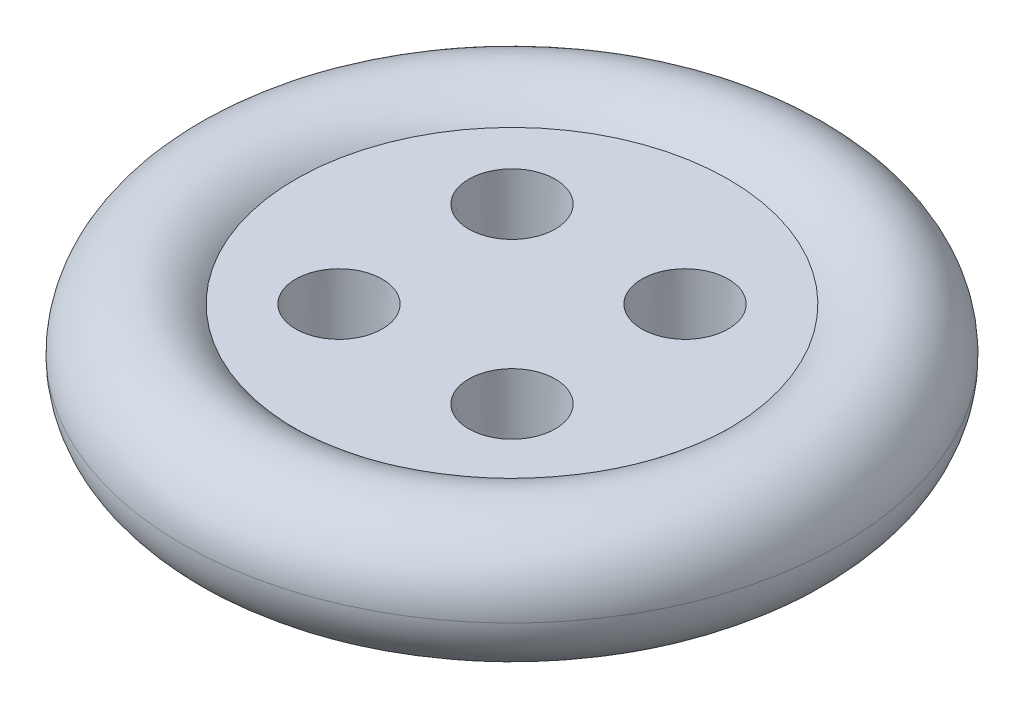
ISO-10303-21;
HEADER;
FILE_DESCRIPTION(('STEP AP214'),'2;1');
FILE_NAME('part.step','',(''),(''),'','','');
FILE_SCHEMA(('AUTOMOTIVE_DESIGN { 1 0 10303 214 1 1 1 1 }'));
ENDSEC;
DATA;
#1=APPLICATION_CONTEXT('core data for automotive mechanical design processes');
#2=APPLICATION_PROTOCOL_DEFINITION('international standard','automotive_design',2000,#1);
#3=PRODUCT_CONTEXT('',#1,'mechanical');
#4=PRODUCT('Part','Part','',(#3));
#5=PRODUCT_RELATED_PRODUCT_CATEGORY('part','',(#4));
#6=PRODUCT_DEFINITION_FORMATION('','',#4);
#7=PRODUCT_DEFINITION_CONTEXT('part definition',#1,'design');
#8=PRODUCT_DEFINITION('design','',#6,#7);
#9=PRODUCT_DEFINITION_SHAPE('','',#8);
#10=(LENGTH_UNIT() NAMED_UNIT(*) SI_UNIT(.MILLI.,.METRE.));
#11=(NAMED_UNIT(*) PLANE_ANGLE_UNIT() SI_UNIT($,.RADIAN.));
#12=(NAMED_UNIT(*) SI_UNIT($,.STERADIAN.) SOLID_ANGLE_UNIT());
#13=UNCERTAINTY_MEASURE_WITH_UNIT(LENGTH_MEASURE(1.E-05),#10,'distance_accuracy_value','');
#14=(GEOMETRIC_REPRESENTATION_CONTEXT(3) GLOBAL_UNCERTAINTY_ASSIGNED_CONTEXT((#13)) GLOBAL_UNIT_ASSIGNED_CONTEXT((#10,
#11,#12)) REPRESENTATION_CONTEXT('',''));
#15=CARTESIAN_POINT('',(0.,0.,0.));
#16=DIRECTION('',(0.,0.,1.));
#17=DIRECTION('',(1.,0.,0.));
#18=AXIS2_PLACEMENT_3D('',#15,#16,#17);
#19=CARTESIAN_POINT('',(0.,10.,0.));
#20=DIRECTION('',(0.,-1.,0.));
#21=DIRECTION('',(0.,0.,-1.));
#22=AXIS2_PLACEMENT_3D('',#19,#20,#21);
#23=TOROIDAL_SURFACE('',#22,61.180339887499,15.);
#24=CARTESIAN_POINT('',(0.,0.,0.));
#25=DIRECTION('',(0.,-1.,0.));
#26=DIRECTION('',(0.,0.,-1.));
#27=AXIS2_PLACEMENT_3D('',#24,#25,#26);
#28=CIRCLE('',#27,50.);
#29=CARTESIAN_POINT('',(0.,0.,-50.));
#30=VERTEX_POINT('',#29);
#31=EDGE_CURVE('E44',#30,#30,#28,.T.);
#32=ORIENTED_EDGE('',*,*,#31,.F.);
#33=EDGE_LOOP('',(#32));
#34=FACE_BOUND('',#33,.T.);
#35=CARTESIAN_POINT('',(0.,10.,0.));
#36=DIRECTION('',(0.,-1.,0.));
#37=DIRECTION('',(0.,0.,-1.));
#38=AXIS2_PLACEMENT_3D('',#35,#36,#37);
#39=CIRCLE('',#38,76.1803398874989);
#40=CARTESIAN_POINT('',(0.,10.,-76.1803398874989));
#41=VERTEX_POINT('',#40);
#42=EDGE_CURVE('E10',#41,#41,#39,.T.);
#43=ORIENTED_EDGE('',*,*,#42,.T.);
#44=EDGE_LOOP('',(#43));
#45=FACE_BOUND('',#44,.T.);
#46=ADVANCED_FACE('F37',(#34,#45),#23,.T.);
#47=CARTESIAN_POINT('',(0.,0.,0.));
#48=DIRECTION('',(0.,-1.,0.));
#49=DIRECTION('',(0.,0.,-1.));
#50=AXIS2_PLACEMENT_3D('',#47,#48,#49);
#51=PLANE('',#50);
#52=CARTESIAN_POINT('',(-20.,0.,20.0000000000041));
#53=DIRECTION('',(0.,-1.,0.));
#54=DIRECTION('',(0.,0.,-1.));
#55=AXIS2_PLACEMENT_3D('',#52,#53,#54);
#56=CIRCLE('',#55,9.65089870143983);
#57=CARTESIAN_POINT('',(-20.,0.,10.3491012985643));
#58=VERTEX_POINT('',#57);
#59=EDGE_CURVE('E53',#58,#58,#56,.T.);
#60=ORIENTED_EDGE('',*,*,#59,.F.);
#61=EDGE_LOOP('',(#60));
#62=FACE_BOUND('',#61,.T.);
#63=CARTESIAN_POINT('',(20.0000000000041,0.,20.0000000000041));
#64=DIRECTION('',(0.,-1.,0.));
#65=DIRECTION('',(0.,0.,-1.));
#66=AXIS2_PLACEMENT_3D('',#63,#64,#65);
#67=CIRCLE('',#66,9.65089870143854);
#68=CARTESIAN_POINT('',(20.0000000000041,0.,10.3491012985656));
#69=VERTEX_POINT('',#68);
#70=EDGE_CURVE('E59',#69,#69,#67,.T.);
#71=ORIENTED_EDGE('',*,*,#70,.F.);
#72=EDGE_LOOP('',(#71));
#73=FACE_BOUND('',#72,.T.);
#74=CARTESIAN_POINT('',(20.0000000000041,0.,-20.));
#75=DIRECTION('',(0.,-1.,0.));
#76=DIRECTION('',(0.,0.,-1.));
#77=AXIS2_PLACEMENT_3D('',#74,#75,#76);
#78=CIRCLE('',#77,9.65089870143453);
#79=CARTESIAN_POINT('',(20.0000000000041,0.,-29.6508987014345));
#80=VERTEX_POINT('',#79);
#81=EDGE_CURVE('E63',#80,#80,#78,.T.);
#82=ORIENTED_EDGE('',*,*,#81,.F.);
#83=EDGE_LOOP('',(#82));
#84=FACE_BOUND('',#83,.T.);
#85=CARTESIAN_POINT('',(-20.,0.,-20.));
#86=DIRECTION('',(0.,-1.,0.));
#87=DIRECTION('',(0.,0.,-1.));
#88=AXIS2_PLACEMENT_3D('',#85,#86,#87);
#89=CIRCLE('',#88,9.65089870143565);
#90=CARTESIAN_POINT('',(-20.,0.,-29.6508987014357));
#91=VERTEX_POINT('',#90);
#92=EDGE_CURVE('E60',#91,#91,#89,.T.);
#93=ORIENTED_EDGE('',*,*,#92,.F.);
#94=EDGE_LOOP('',(#93));
#95=FACE_BOUND('',#94,.T.);
#96=ORIENTED_EDGE('',*,*,#31,.T.);
#97=EDGE_LOOP('',(#96));
#98=FACE_BOUND('',#97,.T.);
#99=ADVANCED_FACE('F72',(#62,#73,#84,#95,#98),#51,.T.);
#100=ORIENTED_EDGE('',*,*,#42,.F.);
#101=EDGE_LOOP('',(#100));
#102=FACE_BOUND('',#101,.T.);
#103=CARTESIAN_POINT('',(0.,20.,0.));
#104=DIRECTION('',(0.,-1.,0.));
#105=DIRECTION('',(0.,0.,-1.));
#106=AXIS2_PLACEMENT_3D('',#103,#104,#105);
#107=CIRCLE('',#106,50.);
#108=CARTESIAN_POINT('',(0.,20.,-50.));
#109=VERTEX_POINT('',#108);
#110=EDGE_CURVE('E48',#109,#109,#107,.T.);
#111=ORIENTED_EDGE('',*,*,#110,.T.);
#112=EDGE_LOOP('',(#111));
#113=FACE_BOUND('',#112,.T.);
#114=ADVANCED_FACE('F75',(#102,#113),#23,.T.);
#115=CARTESIAN_POINT('',(0.,20.,0.));
#116=DIRECTION('',(0.,-1.,0.));
#117=DIRECTION('',(0.,0.,-1.));
#118=AXIS2_PLACEMENT_3D('',#115,#116,#117);
#119=PLANE('',#118);
#120=CARTESIAN_POINT('',(-20.,20.,20.0000000000041));
#121=DIRECTION('',(0.,1.,0.));
#122=DIRECTION('',(0.,0.,1.));
#123=AXIS2_PLACEMENT_3D('',#120,#121,#122);
#124=CIRCLE('',#123,10.0000000000042);
#125=CARTESIAN_POINT('',(-20.,20.,30.0000000000083));
#126=VERTEX_POINT('',#125);
#127=EDGE_CURVE('E94',#126,#126,#124,.T.);
#128=ORIENTED_EDGE('',*,*,#127,.F.);
#129=EDGE_LOOP('',(#128));
#130=FACE_BOUND('',#129,.T.);
#131=CARTESIAN_POINT('',(20.0000000000041,20.,20.0000000000041));
#132=DIRECTION('',(0.,1.,0.));
#133=DIRECTION('',(0.,0.,1.));
#134=AXIS2_PLACEMENT_3D('',#131,#132,#133);
#135=CIRCLE('',#134,10.0000000000029);
#136=CARTESIAN_POINT('',(20.0000000000041,20.,30.000000000007));
#137=VERTEX_POINT('',#136);
#138=EDGE_CURVE('E91',#137,#137,#135,.T.);
#139=ORIENTED_EDGE('',*,*,#138,.F.);
#140=EDGE_LOOP('',(#139));
#141=FACE_BOUND('',#140,.T.);
#142=CARTESIAN_POINT('',(20.0000000000041,20.,-20.));
#143=DIRECTION('',(0.,1.,0.));
#144=DIRECTION('',(0.,0.,1.));
#145=AXIS2_PLACEMENT_3D('',#142,#143,#144);
#146=CIRCLE('',#145,9.99999999999888);
#147=CARTESIAN_POINT('',(20.0000000000041,20.,-10.0000000000011));
#148=VERTEX_POINT('',#147);
#149=EDGE_CURVE('E89',#148,#148,#146,.T.);
#150=ORIENTED_EDGE('',*,*,#149,.F.);
#151=EDGE_LOOP('',(#150));
#152=FACE_BOUND('',#151,.T.);
#153=CARTESIAN_POINT('',(-20.,20.,-20.));
#154=DIRECTION('',(0.,1.,0.));
#155=DIRECTION('',(0.,0.,1.));
#156=AXIS2_PLACEMENT_3D('',#153,#154,#155);
#157=CIRCLE('',#156,10.);
#158=CARTESIAN_POINT('',(-20.,20.,-10.));
#159=VERTEX_POINT('',#158);
#160=EDGE_CURVE('E64',#159,#159,#157,.T.);
#161=ORIENTED_EDGE('',*,*,#160,.F.);
#162=EDGE_LOOP('',(#161));
#163=FACE_BOUND('',#162,.T.);
#164=ORIENTED_EDGE('',*,*,#110,.F.);
#165=EDGE_LOOP('',(#164));
#166=FACE_BOUND('',#165,.T.);
#167=ADVANCED_FACE('F85',(#130,#141,#152,#163,#166),#119,.F.);
#168=CARTESIAN_POINT('',(-20.,20.,-20.));
#169=DIRECTION('',(0.,1.,0.));
#170=DIRECTION('',(0.,0.,1.));
#171=AXIS2_PLACEMENT_3D('',#168,#169,#170);
#172=CONICAL_SURFACE('',#171,10.,0.0174532925199433);
#173=ORIENTED_EDGE('',*,*,#92,.T.);
#174=EDGE_LOOP('',(#173));
#175=FACE_BOUND('',#174,.T.);
#176=ORIENTED_EDGE('',*,*,#160,.T.);
#177=EDGE_LOOP('',(#176));
#178=FACE_BOUND('',#177,.T.);
#179=ADVANCED_FACE('F39',(#175,#178),#172,.F.);
#180=CARTESIAN_POINT('',(20.0000000000041,20.,-20.));
#181=DIRECTION('',(0.,1.,0.));
#182=DIRECTION('',(0.,0.,1.));
#183=AXIS2_PLACEMENT_3D('',#180,#181,#182);
#184=CONICAL_SURFACE('',#183,9.99999999999888,0.0174532925199433);
#185=ORIENTED_EDGE('',*,*,#81,.T.);
#186=EDGE_LOOP('',(#185));
#187=FACE_BOUND('',#186,.T.);
#188=ORIENTED_EDGE('',*,*,#149,.T.);
#189=EDGE_LOOP('',(#188));
#190=FACE_BOUND('',#189,.T.);
#191=ADVANCED_FACE('F84',(#187,#190),#184,.F.);
#192=CARTESIAN_POINT('',(20.0000000000041,20.,20.0000000000041));
#193=DIRECTION('',(0.,1.,0.));
#194=DIRECTION('',(0.,0.,1.));
#195=AXIS2_PLACEMENT_3D('',#192,#193,#194);
#196=CONICAL_SURFACE('',#195,10.0000000000029,0.0174532925199433);
#197=ORIENTED_EDGE('',*,*,#70,.T.);
#198=EDGE_LOOP('',(#197));
#199=FACE_BOUND('',#198,.T.);
#200=ORIENTED_EDGE('',*,*,#138,.T.);
#201=EDGE_LOOP('',(#200));
#202=FACE_BOUND('',#201,.T.);
#203=ADVANCED_FACE('F69',(#199,#202),#196,.F.);
#204=CARTESIAN_POINT('',(-20.,20.,20.0000000000041));
#205=DIRECTION('',(0.,1.,0.));
#206=DIRECTION('',(0.,0.,1.));
#207=AXIS2_PLACEMENT_3D('',#204,#205,#206);
#208=CONICAL_SURFACE('',#207,10.0000000000042,0.0174532925199433);
#209=ORIENTED_EDGE('',*,*,#59,.T.);
#210=EDGE_LOOP('',(#209));
#211=FACE_BOUND('',#210,.T.);
#212=ORIENTED_EDGE('',*,*,#127,.T.);
#213=EDGE_LOOP('',(#212));
#214=FACE_BOUND('',#213,.T.);
#215=ADVANCED_FACE('F161',(#211,#214),#208,.F.);
#216=CLOSED_SHELL('',(#46,#99,#114,#167,#179,#191,#203,#215));
#217=MANIFOLD_SOLID_BREP('B2',#216);
#218=ADVANCED_BREP_SHAPE_REPRESENTATION('',(#18,#217),#14);
#219=SHAPE_DEFINITION_REPRESENTATION(#9,#218);
ENDSEC;
END-ISO-10303-21;
